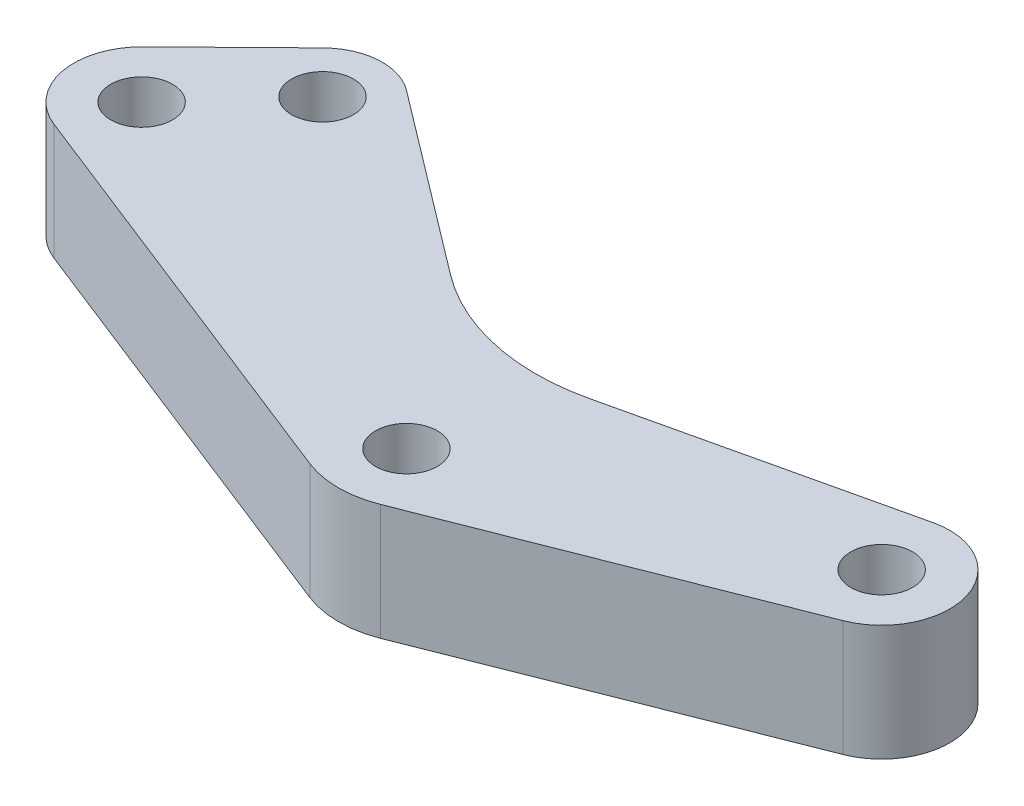
ISO-10303-21;
HEADER;
FILE_DESCRIPTION(('STEP AP214'),'2;1');
FILE_NAME('part.step','',(''),(''),'','','');
FILE_SCHEMA(('AUTOMOTIVE_DESIGN { 1 0 10303 214 1 1 1 1 }'));
ENDSEC;
DATA;
#1=APPLICATION_CONTEXT('core data for automotive mechanical design processes');
#2=APPLICATION_PROTOCOL_DEFINITION('international standard','automotive_design',2000,#1);
#3=PRODUCT_CONTEXT('',#1,'mechanical');
#4=PRODUCT('Part','Part','',(#3));
#5=PRODUCT_RELATED_PRODUCT_CATEGORY('part','',(#4));
#6=PRODUCT_DEFINITION_FORMATION('','',#4);
#7=PRODUCT_DEFINITION_CONTEXT('part definition',#1,'design');
#8=PRODUCT_DEFINITION('design','',#6,#7);
#9=PRODUCT_DEFINITION_SHAPE('','',#8);
#10=(LENGTH_UNIT() NAMED_UNIT(*) SI_UNIT(.MILLI.,.METRE.));
#11=(NAMED_UNIT(*) PLANE_ANGLE_UNIT() SI_UNIT($,.RADIAN.));
#12=(NAMED_UNIT(*) SI_UNIT($,.STERADIAN.) SOLID_ANGLE_UNIT());
#13=UNCERTAINTY_MEASURE_WITH_UNIT(LENGTH_MEASURE(1.E-05),#10,'distance_accuracy_value','');
#14=(GEOMETRIC_REPRESENTATION_CONTEXT(3) GLOBAL_UNCERTAINTY_ASSIGNED_CONTEXT((#13)) GLOBAL_UNIT_ASSIGNED_CONTEXT((#10,
#11,#12)) REPRESENTATION_CONTEXT('',''));
#15=CARTESIAN_POINT('',(0.,0.,0.));
#16=DIRECTION('',(0.,0.,1.));
#17=DIRECTION('',(1.,0.,0.));
#18=AXIS2_PLACEMENT_3D('',#15,#16,#17);
#19=CARTESIAN_POINT('',(-1.80411241501588E-13,0.,-17.6915189579474));
#20=DIRECTION('',(0.,-1.,0.));
#21=DIRECTION('',(0.,0.,-1.));
#22=AXIS2_PLACEMENT_3D('',#19,#20,#21);
#23=CYLINDRICAL_SURFACE('',#22,11.0000000000002);
#24=CARTESIAN_POINT('',(-1.80411241501588E-13,0.,-17.6915189579474));
#25=DIRECTION('',(0.,1.,0.));
#26=DIRECTION('',(0.,0.,1.));
#27=AXIS2_PLACEMENT_3D('',#24,#25,#26);
#28=CIRCLE('',#27,11.0000000000002);
#29=CARTESIAN_POINT('',(-6.64388771167761,0.,-8.92460638426296));
#30=VERTEX_POINT('',#29);
#31=CARTESIAN_POINT('',(2.47073364830324,0.,-6.97258826318377));
#32=VERTEX_POINT('',#31);
#33=EDGE_CURVE('E190',#30,#32,#28,.T.);
#34=ORIENTED_EDGE('',*,*,#33,.T.);
#35=DIRECTION('',(0.,-1.,0.));
#36=VECTOR('',#35,1.);
#37=CARTESIAN_POINT('',(2.47073364830324,4.,-6.97258826318377));
#38=LINE('',#37,#36);
#39=CARTESIAN_POINT('',(2.47073364830324,-6.,-6.97258826318377));
#40=VERTEX_POINT('',#39);
#41=EDGE_CURVE('E169',#32,#40,#38,.T.);
#42=ORIENTED_EDGE('',*,*,#41,.T.);
#43=CARTESIAN_POINT('',(-1.80411241501588E-13,-6.,-17.6915189579474));
#44=DIRECTION('',(0.,1.,0.));
#45=DIRECTION('',(0.,0.,1.));
#46=AXIS2_PLACEMENT_3D('',#43,#44,#45);
#47=CIRCLE('',#46,11.0000000000002);
#48=CARTESIAN_POINT('',(-6.64388771167761,-6.,-8.92460638426296));
#49=VERTEX_POINT('',#48);
#50=EDGE_CURVE('E207',#49,#40,#47,.T.);
#51=ORIENTED_EDGE('',*,*,#50,.F.);
#52=DIRECTION('',(0.,-1.,0.));
#53=VECTOR('',#52,1.);
#54=CARTESIAN_POINT('',(-6.64388771167761,0.,-8.92460638426296));
#55=LINE('',#54,#53);
#56=EDGE_CURVE('E210',#30,#49,#55,.T.);
#57=ORIENTED_EDGE('',*,*,#56,.F.);
#58=EDGE_LOOP('',(#34,#42,#51,#57));
#59=FACE_BOUND('',#58,.T.);
#60=ADVANCED_FACE('F87',(#59),#23,.F.);
#61=CARTESIAN_POINT('',(22.3766543909561,0.,-8.67671241126073));
#62=DIRECTION('',(0.,-1.,0.));
#63=DIRECTION('',(0.,0.,-1.));
#64=AXIS2_PLACEMENT_3D('',#61,#62,#63);
#65=PLANE('',#64);
#66=CARTESIAN_POINT('',(-17.9323211734452,0.,-13.58977031934));
#67=DIRECTION('',(0.,-1.,0.));
#68=DIRECTION('',(0.,0.,1.));
#69=AXIS2_PLACEMENT_3D('',#66,#67,#68);
#70=CIRCLE('',#69,1.6);
#71=CARTESIAN_POINT('',(-17.9323211734452,0.,-11.98977031934));
#72=VERTEX_POINT('',#71);
#73=EDGE_CURVE('E182',#72,#72,#70,.T.);
#74=ORIENTED_EDGE('',*,*,#73,.T.);
#75=EDGE_LOOP('',(#74));
#76=FACE_BOUND('',#75,.T.);
#77=CARTESIAN_POINT('',(0.,0.,0.));
#78=DIRECTION('',(0.,-1.,0.));
#79=DIRECTION('',(0.,0.,1.));
#80=AXIS2_PLACEMENT_3D('',#77,#78,#79);
#81=CIRCLE('',#80,1.60000000000001);
#82=CARTESIAN_POINT('',(0.,0.,1.60000000000001));
#83=VERTEX_POINT('',#82);
#84=EDGE_CURVE('E240',#83,#83,#81,.T.);
#85=ORIENTED_EDGE('',*,*,#84,.T.);
#86=EDGE_LOOP('',(#85));
#87=FACE_BOUND('',#86,.T.);
#88=CARTESIAN_POINT('',(-22.3766543909561,0.,-8.67671241126073));
#89=DIRECTION('',(0.,-1.,0.));
#90=DIRECTION('',(0.,0.,1.));
#91=AXIS2_PLACEMENT_3D('',#88,#89,#90);
#92=CIRCLE('',#91,1.6);
#93=CARTESIAN_POINT('',(-22.3766543909561,0.,-7.07671241126072));
#94=VERTEX_POINT('',#93);
#95=EDGE_CURVE('E234',#94,#94,#92,.T.);
#96=ORIENTED_EDGE('',*,*,#95,.T.);
#97=EDGE_LOOP('',(#96));
#98=FACE_BOUND('',#97,.T.);
#99=CARTESIAN_POINT('',(17.7148513928404,0.,-6.86906399224811));
#100=DIRECTION('',(0.,-1.,0.));
#101=DIRECTION('',(0.,0.,-1.));
#102=AXIS2_PLACEMENT_3D('',#99,#100,#101);
#103=CIRCLE('',#102,3.52489310322834);
#104=CARTESIAN_POINT('',(16.9231175749478,0.,-10.3038898904258));
#105=VERTEX_POINT('',#104);
#106=CARTESIAN_POINT('',(19.0055511829039,0.,-3.58897779808848));
#107=VERTEX_POINT('',#106);
#108=EDGE_CURVE('E165',#105,#107,#103,.T.);
#109=ORIENTED_EDGE('',*,*,#108,.F.);
#110=DIRECTION('',(0.974448244978493,0.,-0.224612149845762));
#111=VECTOR('',#110,1.);
#112=CARTESIAN_POINT('',(21.7453750106333,0.,-11.4154292824054));
#113=LINE('',#112,#111);
#114=EDGE_CURVE('E157',#32,#105,#113,.T.);
#115=ORIENTED_EDGE('',*,*,#114,.F.);
#116=ORIENTED_EDGE('',*,*,#33,.F.);
#117=DIRECTION('',(0.796992052153114,0.,0.603989791970665));
#118=VECTOR('',#117,1.);
#119=CARTESIAN_POINT('',(-16.0599528183362,0.,-16.0604456810146));
#120=LINE('',#119,#118);
#121=CARTESIAN_POINT('',(-16.0599528183362,0.,-16.0604456810146));
#122=VERTEX_POINT('',#121);
#123=EDGE_CURVE('E262',#122,#30,#120,.T.);
#124=ORIENTED_EDGE('',*,*,#123,.F.);
#125=CARTESIAN_POINT('',(-17.9323211734452,0.,-13.58977031934));
#126=DIRECTION('',(0.,-1.,0.));
#127=DIRECTION('',(0.,0.,-1.));
#128=AXIS2_PLACEMENT_3D('',#125,#126,#127);
#129=CIRCLE('',#128,3.09999999999993);
#130=CARTESIAN_POINT('',(-20.1015148578983,0.,-15.8044031916979));
#131=VERTEX_POINT('',#130);
#132=EDGE_CURVE('E260',#131,#122,#129,.T.);
#133=ORIENTED_EDGE('',*,*,#132,.F.);
#134=DIRECTION('',(0.714397700760627,0.,-0.699739898210707));
#135=VECTOR('',#134,1.);
#136=CARTESIAN_POINT('',(-24.8257440346936,0.,-11.1771043639229));
#137=LINE('',#136,#135);
#138=CARTESIAN_POINT('',(-24.8257440346936,0.,-11.1771043639229));
#139=VERTEX_POINT('',#138);
#140=EDGE_CURVE('E257',#139,#131,#137,.T.);
#141=ORIENTED_EDGE('',*,*,#140,.F.);
#142=CARTESIAN_POINT('',(-22.3766543909561,0.,-8.67671241126073));
#143=DIRECTION('',(0.,-1.,0.));
#144=DIRECTION('',(0.,0.,-1.));
#145=AXIS2_PLACEMENT_3D('',#142,#143,#144);
#146=CIRCLE('',#145,3.49999999999999);
#147=CARTESIAN_POINT('',(-23.658239146274,0.,-5.41979047253749));
#148=VERTEX_POINT('',#147);
#149=EDGE_CURVE('E254',#148,#139,#146,.T.);
#150=ORIENTED_EDGE('',*,*,#149,.F.);
#151=DIRECTION('',(-0.930549125349499,0.,-0.366167072947968));
#152=VECTOR('',#151,1.);
#153=CARTESIAN_POINT('',(-1.83083536474049,0.,3.16919890482149));
#154=LINE('',#153,#152);
#155=CARTESIAN_POINT('',(-1.83083536474049,0.,3.16919890482149));
#156=VERTEX_POINT('',#155);
#157=EDGE_CURVE('E251',#156,#148,#154,.T.);
#158=ORIENTED_EDGE('',*,*,#157,.F.);
#159=CARTESIAN_POINT('',(-6.45317133063372E-13,0.,-1.48354672192603));
#160=DIRECTION('',(0.,-1.,0.));
#161=DIRECTION('',(0.,0.,-1.));
#162=AXIS2_PLACEMENT_3D('',#159,#160,#161);
#163=CIRCLE('',#162,5.00000000000002);
#164=CARTESIAN_POINT('',(1.83083536473912,0.,3.16919890482151));
#165=VERTEX_POINT('',#164);
#166=EDGE_CURVE('E248',#165,#156,#163,.T.);
#167=ORIENTED_EDGE('',*,*,#166,.F.);
#168=DIRECTION('',(-0.930549125349505,0.,0.366167072947952));
#169=VECTOR('',#168,1.);
#170=CARTESIAN_POINT('',(23.6582391462739,0.,-5.41979047253755));
#171=LINE('',#170,#169);
#172=EDGE_CURVE('E209',#107,#165,#171,.T.);
#173=ORIENTED_EDGE('',*,*,#172,.F.);
#174=EDGE_LOOP('',(#109,#115,#116,#124,#133,#141,#150,#158,#167,#173));
#175=FACE_BOUND('',#174,.T.);
#176=CARTESIAN_POINT('',(17.7148513928404,0.,-6.86906399224811));
#177=DIRECTION('',(0.,-1.,0.));
#178=DIRECTION('',(0.,0.,-1.));
#179=AXIS2_PLACEMENT_3D('',#176,#177,#178);
#180=CIRCLE('',#179,1.60000000000001);
#181=CARTESIAN_POINT('',(17.7148513928404,0.,-8.46906399224812));
#182=VERTEX_POINT('',#181);
#183=EDGE_CURVE('E225',#182,#182,#180,.F.);
#184=ORIENTED_EDGE('',*,*,#183,.F.);
#185=EDGE_LOOP('',(#184));
#186=FACE_BOUND('',#185,.T.);
#187=ADVANCED_FACE('F272',(#76,#87,#98,#175,#186),#65,.F.);
#188=CARTESIAN_POINT('',(22.3766543909561,-6.,-8.67671241126073));
#189=DIRECTION('',(0.,-1.,0.));
#190=DIRECTION('',(0.,0.,-1.));
#191=AXIS2_PLACEMENT_3D('',#188,#189,#190);
#192=PLANE('',#191);
#193=DIRECTION('',(0.974448244978493,0.,-0.224612149845762));
#194=VECTOR('',#193,1.);
#195=CARTESIAN_POINT('',(2.47073364830324,-6.,-6.97258826318377));
#196=LINE('',#195,#194);
#197=CARTESIAN_POINT('',(16.9231175749478,-6.,-10.3038898904258));
#198=VERTEX_POINT('',#197);
#199=EDGE_CURVE('E96',#40,#198,#196,.T.);
#200=ORIENTED_EDGE('',*,*,#199,.T.);
#201=CARTESIAN_POINT('',(17.7148513928404,-6.,-6.86906399224811));
#202=DIRECTION('',(0.,-1.,0.));
#203=DIRECTION('',(0.,0.,-1.));
#204=AXIS2_PLACEMENT_3D('',#201,#202,#203);
#205=CIRCLE('',#204,3.52489310322834);
#206=CARTESIAN_POINT('',(19.0055511829039,-6.,-3.58897779808848));
#207=VERTEX_POINT('',#206);
#208=EDGE_CURVE('E12',#198,#207,#205,.T.);
#209=ORIENTED_EDGE('',*,*,#208,.T.);
#210=DIRECTION('',(-0.930549125349505,0.,0.366167072947952));
#211=VECTOR('',#210,1.);
#212=CARTESIAN_POINT('',(23.6582391462739,-6.,-5.41979047253755));
#213=LINE('',#212,#211);
#214=CARTESIAN_POINT('',(1.83083536473912,-6.,3.16919890482151));
#215=VERTEX_POINT('',#214);
#216=EDGE_CURVE('E175',#207,#215,#213,.T.);
#217=ORIENTED_EDGE('',*,*,#216,.T.);
#218=CARTESIAN_POINT('',(-6.45317133063372E-13,-6.,-1.48354672192603));
#219=DIRECTION('',(0.,-1.,0.));
#220=DIRECTION('',(0.,0.,-1.));
#221=AXIS2_PLACEMENT_3D('',#218,#219,#220);
#222=CIRCLE('',#221,5.00000000000002);
#223=CARTESIAN_POINT('',(-1.83083536474049,-6.,3.16919890482149));
#224=VERTEX_POINT('',#223);
#225=EDGE_CURVE('E181',#215,#224,#222,.T.);
#226=ORIENTED_EDGE('',*,*,#225,.T.);
#227=DIRECTION('',(-0.930549125349499,0.,-0.366167072947968));
#228=VECTOR('',#227,1.);
#229=CARTESIAN_POINT('',(-1.83083536474049,-6.,3.16919890482149));
#230=LINE('',#229,#228);
#231=CARTESIAN_POINT('',(-23.658239146274,-6.,-5.41979047253749));
#232=VERTEX_POINT('',#231);
#233=EDGE_CURVE('E184',#224,#232,#230,.T.);
#234=ORIENTED_EDGE('',*,*,#233,.T.);
#235=CARTESIAN_POINT('',(-22.3766543909561,-6.,-8.67671241126073));
#236=DIRECTION('',(0.,-1.,0.));
#237=DIRECTION('',(0.,0.,-1.));
#238=AXIS2_PLACEMENT_3D('',#235,#236,#237);
#239=CIRCLE('',#238,3.49999999999999);
#240=CARTESIAN_POINT('',(-24.8257440346936,-6.,-11.1771043639229));
#241=VERTEX_POINT('',#240);
#242=EDGE_CURVE('E195',#232,#241,#239,.T.);
#243=ORIENTED_EDGE('',*,*,#242,.T.);
#244=DIRECTION('',(0.714397700760627,0.,-0.699739898210707));
#245=VECTOR('',#244,1.);
#246=CARTESIAN_POINT('',(-24.8257440346936,-6.,-11.1771043639229));
#247=LINE('',#246,#245);
#248=CARTESIAN_POINT('',(-20.1015148578983,-6.,-15.8044031916979));
#249=VERTEX_POINT('',#248);
#250=EDGE_CURVE('E198',#241,#249,#247,.T.);
#251=ORIENTED_EDGE('',*,*,#250,.T.);
#252=CARTESIAN_POINT('',(-17.9323211734452,-6.,-13.58977031934));
#253=DIRECTION('',(0.,-1.,0.));
#254=DIRECTION('',(0.,0.,-1.));
#255=AXIS2_PLACEMENT_3D('',#252,#253,#254);
#256=CIRCLE('',#255,3.09999999999993);
#257=CARTESIAN_POINT('',(-16.0599528183362,-6.,-16.0604456810146));
#258=VERTEX_POINT('',#257);
#259=EDGE_CURVE('E201',#249,#258,#256,.T.);
#260=ORIENTED_EDGE('',*,*,#259,.T.);
#261=DIRECTION('',(0.796992052153114,0.,0.603989791970665));
#262=VECTOR('',#261,1.);
#263=CARTESIAN_POINT('',(-16.0599528183362,-6.,-16.0604456810146));
#264=LINE('',#263,#262);
#265=EDGE_CURVE('E204',#258,#49,#264,.T.);
#266=ORIENTED_EDGE('',*,*,#265,.T.);
#267=ORIENTED_EDGE('',*,*,#50,.T.);
#268=EDGE_LOOP('',(#200,#209,#217,#226,#234,#243,#251,#260,#266,#267));
#269=FACE_BOUND('',#268,.T.);
#270=CARTESIAN_POINT('',(-17.9323211734452,-6.,-13.58977031934));
#271=DIRECTION('',(0.,-1.,0.));
#272=DIRECTION('',(0.,0.,1.));
#273=AXIS2_PLACEMENT_3D('',#270,#271,#272);
#274=CIRCLE('',#273,1.6);
#275=CARTESIAN_POINT('',(-17.9323211734452,-6.,-11.98977031934));
#276=VERTEX_POINT('',#275);
#277=EDGE_CURVE('E187',#276,#276,#274,.T.);
#278=ORIENTED_EDGE('',*,*,#277,.F.);
#279=EDGE_LOOP('',(#278));
#280=FACE_BOUND('',#279,.T.);
#281=CARTESIAN_POINT('',(0.,-6.,0.));
#282=DIRECTION('',(0.,-1.,0.));
#283=DIRECTION('',(0.,0.,1.));
#284=AXIS2_PLACEMENT_3D('',#281,#282,#283);
#285=CIRCLE('',#284,1.60000000000001);
#286=CARTESIAN_POINT('',(0.,-6.,1.60000000000001));
#287=VERTEX_POINT('',#286);
#288=EDGE_CURVE('E237',#287,#287,#285,.T.);
#289=ORIENTED_EDGE('',*,*,#288,.F.);
#290=EDGE_LOOP('',(#289));
#291=FACE_BOUND('',#290,.T.);
#292=CARTESIAN_POINT('',(-22.3766543909561,-6.,-8.67671241126073));
#293=DIRECTION('',(0.,-1.,0.));
#294=DIRECTION('',(0.,0.,1.));
#295=AXIS2_PLACEMENT_3D('',#292,#293,#294);
#296=CIRCLE('',#295,1.6);
#297=CARTESIAN_POINT('',(-22.3766543909561,-6.,-7.07671241126072));
#298=VERTEX_POINT('',#297);
#299=EDGE_CURVE('E229',#298,#298,#296,.T.);
#300=ORIENTED_EDGE('',*,*,#299,.F.);
#301=EDGE_LOOP('',(#300));
#302=FACE_BOUND('',#301,.T.);
#303=CARTESIAN_POINT('',(17.7148513928404,-6.,-6.86906399224811));
#304=DIRECTION('',(0.,-1.,0.));
#305=DIRECTION('',(0.,0.,-1.));
#306=AXIS2_PLACEMENT_3D('',#303,#304,#305);
#307=CIRCLE('',#306,1.60000000000001);
#308=CARTESIAN_POINT('',(17.7148513928404,-6.,-8.46906399224812));
#309=VERTEX_POINT('',#308);
#310=EDGE_CURVE('E223',#309,#309,#307,.F.);
#311=ORIENTED_EDGE('',*,*,#310,.T.);
#312=EDGE_LOOP('',(#311));
#313=FACE_BOUND('',#312,.T.);
#314=ADVANCED_FACE('F172',(#269,#280,#291,#302,#313),#192,.T.);
#315=CARTESIAN_POINT('',(-16.0599528183362,0.,-16.0604456810146));
#316=DIRECTION('',(0.603989791970665,0.,-0.796992052153114));
#317=DIRECTION('',(-0.796992052153114,0.,-0.603989791970665));
#318=AXIS2_PLACEMENT_3D('',#315,#316,#317);
#319=PLANE('',#318);
#320=ORIENTED_EDGE('',*,*,#265,.F.);
#321=DIRECTION('',(0.,-1.,0.));
#322=VECTOR('',#321,1.);
#323=CARTESIAN_POINT('',(-16.0599528183362,0.,-16.0604456810146));
#324=LINE('',#323,#322);
#325=EDGE_CURVE('E212',#122,#258,#324,.T.);
#326=ORIENTED_EDGE('',*,*,#325,.F.);
#327=ORIENTED_EDGE('',*,*,#123,.T.);
#328=ORIENTED_EDGE('',*,*,#56,.T.);
#329=EDGE_LOOP('',(#320,#326,#327,#328));
#330=FACE_BOUND('',#329,.T.);
#331=ADVANCED_FACE('F294',(#330),#319,.T.);
#332=CARTESIAN_POINT('',(-17.9323211734452,0.,-13.58977031934));
#333=DIRECTION('',(0.,-1.,0.));
#334=DIRECTION('',(0.,0.,-1.));
#335=AXIS2_PLACEMENT_3D('',#332,#333,#334);
#336=CYLINDRICAL_SURFACE('',#335,3.09999999999993);
#337=ORIENTED_EDGE('',*,*,#259,.F.);
#338=DIRECTION('',(0.,-1.,0.));
#339=VECTOR('',#338,1.);
#340=CARTESIAN_POINT('',(-20.1015148578983,0.,-15.8044031916979));
#341=LINE('',#340,#339);
#342=EDGE_CURVE('E214',#131,#249,#341,.T.);
#343=ORIENTED_EDGE('',*,*,#342,.F.);
#344=ORIENTED_EDGE('',*,*,#132,.T.);
#345=ORIENTED_EDGE('',*,*,#325,.T.);
#346=EDGE_LOOP('',(#337,#343,#344,#345));
#347=FACE_BOUND('',#346,.T.);
#348=ADVANCED_FACE('F293',(#347),#336,.T.);
#349=CARTESIAN_POINT('',(-24.8257440346936,0.,-11.1771043639229));
#350=DIRECTION('',(-0.699739898210706,0.,-0.714397700760627));
#351=DIRECTION('',(-0.714397700760627,0.,0.699739898210707));
#352=AXIS2_PLACEMENT_3D('',#349,#350,#351);
#353=PLANE('',#352);
#354=ORIENTED_EDGE('',*,*,#250,.F.);
#355=DIRECTION('',(0.,-1.,0.));
#356=VECTOR('',#355,1.);
#357=CARTESIAN_POINT('',(-24.8257440346936,0.,-11.1771043639229));
#358=LINE('',#357,#356);
#359=EDGE_CURVE('E216',#139,#241,#358,.T.);
#360=ORIENTED_EDGE('',*,*,#359,.F.);
#361=ORIENTED_EDGE('',*,*,#140,.T.);
#362=ORIENTED_EDGE('',*,*,#342,.T.);
#363=EDGE_LOOP('',(#354,#360,#361,#362));
#364=FACE_BOUND('',#363,.T.);
#365=ADVANCED_FACE('F289',(#364),#353,.T.);
#366=CARTESIAN_POINT('',(-22.3766543909561,0.,-8.67671241126073));
#367=DIRECTION('',(0.,-1.,0.));
#368=DIRECTION('',(0.,0.,-1.));
#369=AXIS2_PLACEMENT_3D('',#366,#367,#368);
#370=CYLINDRICAL_SURFACE('',#369,3.49999999999999);
#371=ORIENTED_EDGE('',*,*,#242,.F.);
#372=DIRECTION('',(0.,-1.,0.));
#373=VECTOR('',#372,1.);
#374=CARTESIAN_POINT('',(-23.658239146274,0.,-5.41979047253749));
#375=LINE('',#374,#373);
#376=EDGE_CURVE('E218',#148,#232,#375,.T.);
#377=ORIENTED_EDGE('',*,*,#376,.F.);
#378=ORIENTED_EDGE('',*,*,#149,.T.);
#379=ORIENTED_EDGE('',*,*,#359,.T.);
#380=EDGE_LOOP('',(#371,#377,#378,#379));
#381=FACE_BOUND('',#380,.T.);
#382=ADVANCED_FACE('F285',(#381),#370,.T.);
#383=CARTESIAN_POINT('',(-1.83083536474049,0.,3.16919890482149));
#384=DIRECTION('',(-0.366167072947968,0.,0.930549125349499));
#385=DIRECTION('',(0.930549125349499,0.,0.366167072947968));
#386=AXIS2_PLACEMENT_3D('',#383,#384,#385);
#387=PLANE('',#386);
#388=ORIENTED_EDGE('',*,*,#233,.F.);
#389=DIRECTION('',(0.,-1.,0.));
#390=VECTOR('',#389,1.);
#391=CARTESIAN_POINT('',(-1.83083536474049,0.,3.16919890482149));
#392=LINE('',#391,#390);
#393=EDGE_CURVE('E220',#156,#224,#392,.T.);
#394=ORIENTED_EDGE('',*,*,#393,.F.);
#395=ORIENTED_EDGE('',*,*,#157,.T.);
#396=ORIENTED_EDGE('',*,*,#376,.T.);
#397=EDGE_LOOP('',(#388,#394,#395,#396));
#398=FACE_BOUND('',#397,.T.);
#399=ADVANCED_FACE('F282',(#398),#387,.T.);
#400=CARTESIAN_POINT('',(-6.45317133063372E-13,0.,-1.48354672192603));
#401=DIRECTION('',(0.,-1.,0.));
#402=DIRECTION('',(0.,0.,-1.));
#403=AXIS2_PLACEMENT_3D('',#400,#401,#402);
#404=CYLINDRICAL_SURFACE('',#403,5.00000000000002);
#405=ORIENTED_EDGE('',*,*,#225,.F.);
#406=DIRECTION('',(0.,-1.,0.));
#407=VECTOR('',#406,1.);
#408=CARTESIAN_POINT('',(1.83083536473912,0.,3.16919890482151));
#409=LINE('',#408,#407);
#410=EDGE_CURVE('E179',#165,#215,#409,.T.);
#411=ORIENTED_EDGE('',*,*,#410,.F.);
#412=ORIENTED_EDGE('',*,*,#166,.T.);
#413=ORIENTED_EDGE('',*,*,#393,.T.);
#414=EDGE_LOOP('',(#405,#411,#412,#413));
#415=FACE_BOUND('',#414,.T.);
#416=ADVANCED_FACE('F278',(#415),#404,.T.);
#417=CARTESIAN_POINT('',(23.6582391462739,0.,-5.41979047253755));
#418=DIRECTION('',(0.366167072947952,0.,0.930549125349505));
#419=DIRECTION('',(0.930549125349505,0.,-0.366167072947952));
#420=AXIS2_PLACEMENT_3D('',#417,#418,#419);
#421=PLANE('',#420);
#422=DIRECTION('',(0.,-1.,0.));
#423=VECTOR('',#422,1.);
#424=CARTESIAN_POINT('',(19.0055511829039,4.,-3.58897779808848));
#425=LINE('',#424,#423);
#426=EDGE_CURVE('E161',#107,#207,#425,.T.);
#427=ORIENTED_EDGE('',*,*,#426,.F.);
#428=ORIENTED_EDGE('',*,*,#172,.T.);
#429=ORIENTED_EDGE('',*,*,#410,.T.);
#430=ORIENTED_EDGE('',*,*,#216,.F.);
#431=EDGE_LOOP('',(#427,#428,#429,#430));
#432=FACE_BOUND('',#431,.T.);
#433=ADVANCED_FACE('F89',(#432),#421,.T.);
#434=CARTESIAN_POINT('',(-17.9323211734452,0.,-13.58977031934));
#435=DIRECTION('',(0.,-1.,0.));
#436=DIRECTION('',(0.,0.,-1.));
#437=AXIS2_PLACEMENT_3D('',#434,#435,#436);
#438=CYLINDRICAL_SURFACE('',#437,1.6);
#439=ORIENTED_EDGE('',*,*,#73,.F.);
#440=EDGE_LOOP('',(#439));
#441=FACE_BOUND('',#440,.T.);
#442=ORIENTED_EDGE('',*,*,#277,.T.);
#443=EDGE_LOOP('',(#442));
#444=FACE_BOUND('',#443,.T.);
#445=ADVANCED_FACE('F311',(#441,#444),#438,.F.);
#446=CARTESIAN_POINT('',(0.,0.,0.));
#447=DIRECTION('',(0.,-1.,0.));
#448=DIRECTION('',(0.,0.,-1.));
#449=AXIS2_PLACEMENT_3D('',#446,#447,#448);
#450=CYLINDRICAL_SURFACE('',#449,1.60000000000001);
#451=ORIENTED_EDGE('',*,*,#84,.F.);
#452=EDGE_LOOP('',(#451));
#453=FACE_BOUND('',#452,.T.);
#454=ORIENTED_EDGE('',*,*,#288,.T.);
#455=EDGE_LOOP('',(#454));
#456=FACE_BOUND('',#455,.T.);
#457=ADVANCED_FACE('F314',(#453,#456),#450,.F.);
#458=CARTESIAN_POINT('',(-22.3766543909561,0.,-8.67671241126073));
#459=DIRECTION('',(0.,-1.,0.));
#460=DIRECTION('',(0.,0.,-1.));
#461=AXIS2_PLACEMENT_3D('',#458,#459,#460);
#462=CYLINDRICAL_SURFACE('',#461,1.6);
#463=ORIENTED_EDGE('',*,*,#95,.F.);
#464=EDGE_LOOP('',(#463));
#465=FACE_BOUND('',#464,.T.);
#466=ORIENTED_EDGE('',*,*,#299,.T.);
#467=EDGE_LOOP('',(#466));
#468=FACE_BOUND('',#467,.T.);
#469=ADVANCED_FACE('F318',(#465,#468),#462,.F.);
#470=CARTESIAN_POINT('',(17.7148513928404,4.,-6.86906399224811));
#471=DIRECTION('',(0.,-1.,0.));
#472=DIRECTION('',(0.,0.,-1.));
#473=AXIS2_PLACEMENT_3D('',#470,#471,#472);
#474=CYLINDRICAL_SURFACE('',#473,3.52489310322834);
#475=ORIENTED_EDGE('',*,*,#108,.T.);
#476=ORIENTED_EDGE('',*,*,#426,.T.);
#477=ORIENTED_EDGE('',*,*,#208,.F.);
#478=DIRECTION('',(0.,-1.,0.));
#479=VECTOR('',#478,1.);
#480=CARTESIAN_POINT('',(16.9231175749478,4.,-10.3038898904258));
#481=LINE('',#480,#479);
#482=EDGE_CURVE('E103',#105,#198,#481,.T.);
#483=ORIENTED_EDGE('',*,*,#482,.F.);
#484=EDGE_LOOP('',(#475,#476,#477,#483));
#485=FACE_BOUND('',#484,.T.);
#486=ADVANCED_FACE('F162',(#485),#474,.T.);
#487=CARTESIAN_POINT('',(-1.40146068065791,4.,-6.08004020090292));
#488=DIRECTION('',(-0.224612149845762,0.,-0.974448244978493));
#489=DIRECTION('',(-0.974448244978493,0.,0.224612149845762));
#490=AXIS2_PLACEMENT_3D('',#487,#488,#489);
#491=PLANE('',#490);
#492=ORIENTED_EDGE('',*,*,#114,.T.);
#493=ORIENTED_EDGE('',*,*,#482,.T.);
#494=ORIENTED_EDGE('',*,*,#199,.F.);
#495=ORIENTED_EDGE('',*,*,#41,.F.);
#496=EDGE_LOOP('',(#492,#493,#494,#495));
#497=FACE_BOUND('',#496,.T.);
#498=ADVANCED_FACE('F325',(#497),#491,.T.);
#499=CARTESIAN_POINT('',(17.7148513928404,-6.000012,-6.86906399224811));
#500=DIRECTION('',(0.,1.,0.));
#501=DIRECTION('',(0.,0.,1.));
#502=AXIS2_PLACEMENT_3D('',#499,#500,#501);
#503=CYLINDRICAL_SURFACE('',#502,1.60000000000001);
#504=ORIENTED_EDGE('',*,*,#310,.F.);
#505=EDGE_LOOP('',(#504));
#506=FACE_BOUND('',#505,.T.);
#507=ORIENTED_EDGE('',*,*,#183,.T.);
#508=EDGE_LOOP('',(#507));
#509=FACE_BOUND('',#508,.T.);
#510=ADVANCED_FACE('F328',(#506,#509),#503,.F.);
#511=CLOSED_SHELL('',(#60,#187,#314,#331,#348,#365,#382,#399,#416,#433,#445,#457,#469,#486,#498,#510));
#512=MANIFOLD_SOLID_BREP('B2',#511);
#513=ADVANCED_BREP_SHAPE_REPRESENTATION('',(#18,#512),#14);
#514=SHAPE_DEFINITION_REPRESENTATION(#9,#513);
ENDSEC;
END-ISO-10303-21;
